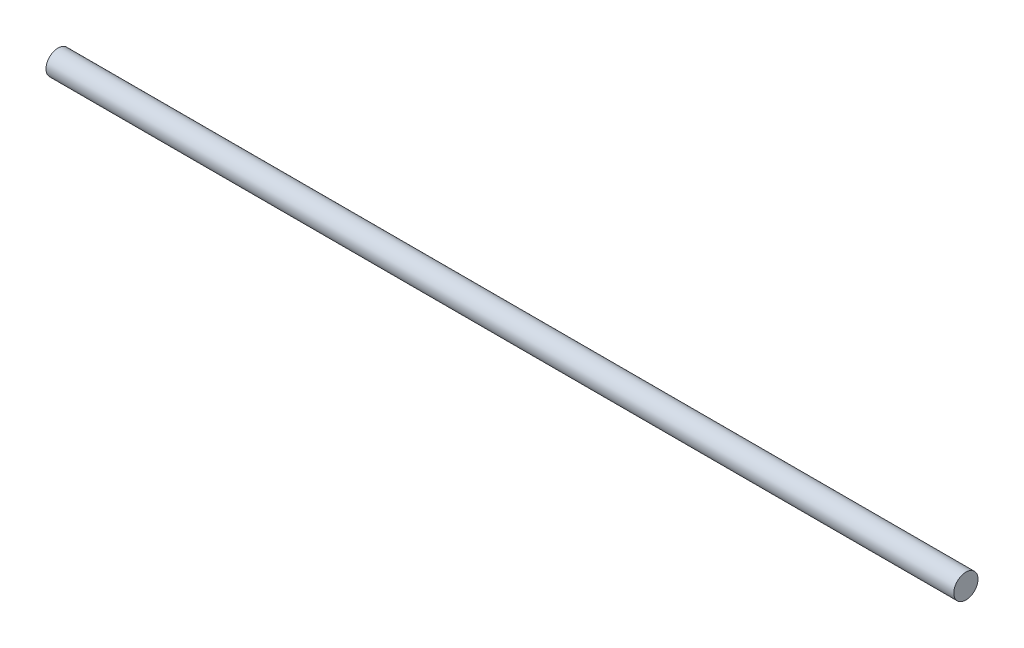
ISO-10303-21;
HEADER;
FILE_DESCRIPTION(('STEP AP214'),'2;1');
FILE_NAME('part.step','',(''),(''),'','','');
FILE_SCHEMA(('AUTOMOTIVE_DESIGN { 1 0 10303 214 1 1 1 1 }'));
ENDSEC;
DATA;
#1=APPLICATION_CONTEXT('core data for automotive mechanical design processes');
#2=APPLICATION_PROTOCOL_DEFINITION('international standard','automotive_design',2000,#1);
#3=PRODUCT_CONTEXT('',#1,'mechanical');
#4=PRODUCT('Part','Part','',(#3));
#5=PRODUCT_RELATED_PRODUCT_CATEGORY('part','',(#4));
#6=PRODUCT_DEFINITION_FORMATION('','',#4);
#7=PRODUCT_DEFINITION_CONTEXT('part definition',#1,'design');
#8=PRODUCT_DEFINITION('design','',#6,#7);
#9=PRODUCT_DEFINITION_SHAPE('','',#8);
#10=(LENGTH_UNIT() NAMED_UNIT(*) SI_UNIT(.MILLI.,.METRE.));
#11=(NAMED_UNIT(*) PLANE_ANGLE_UNIT() SI_UNIT($,.RADIAN.));
#12=(NAMED_UNIT(*) SI_UNIT($,.STERADIAN.) SOLID_ANGLE_UNIT());
#13=UNCERTAINTY_MEASURE_WITH_UNIT(LENGTH_MEASURE(1.E-05),#10,'distance_accuracy_value','');
#14=(GEOMETRIC_REPRESENTATION_CONTEXT(3) GLOBAL_UNCERTAINTY_ASSIGNED_CONTEXT((#13)) GLOBAL_UNIT_ASSIGNED_CONTEXT((#10,
#11,#12)) REPRESENTATION_CONTEXT('',''));
#15=CARTESIAN_POINT('',(0.,0.,0.));
#16=DIRECTION('',(0.,0.,1.));
#17=DIRECTION('',(1.,0.,0.));
#18=AXIS2_PLACEMENT_3D('',#15,#16,#17);
#19=CARTESIAN_POINT('',(600.,0.,0.));
#20=DIRECTION('',(-1.,0.,0.));
#21=DIRECTION('',(0.,0.,1.));
#22=AXIS2_PLACEMENT_3D('',#19,#20,#21);
#23=CYLINDRICAL_SURFACE('',#22,8.);
#24=CARTESIAN_POINT('',(600.,0.,0.));
#25=DIRECTION('',(1.,0.,0.));
#26=DIRECTION('',(0.,0.,-1.));
#27=AXIS2_PLACEMENT_3D('',#24,#25,#26);
#28=CIRCLE('',#27,8.);
#29=CARTESIAN_POINT('',(600.,0.,-8.));
#30=VERTEX_POINT('',#29);
#31=EDGE_CURVE('E10',#30,#30,#28,.T.);
#32=ORIENTED_EDGE('',*,*,#31,.F.);
#33=EDGE_LOOP('',(#32));
#34=FACE_BOUND('',#33,.T.);
#35=CARTESIAN_POINT('',(0.,0.,0.));
#36=DIRECTION('',(1.,0.,0.));
#37=DIRECTION('',(0.,0.,-1.));
#38=AXIS2_PLACEMENT_3D('',#35,#36,#37);
#39=CIRCLE('',#38,8.);
#40=CARTESIAN_POINT('',(0.,0.,-8.));
#41=VERTEX_POINT('',#40);
#42=EDGE_CURVE('E44',#41,#41,#39,.T.);
#43=ORIENTED_EDGE('',*,*,#42,.T.);
#44=EDGE_LOOP('',(#43));
#45=FACE_BOUND('',#44,.T.);
#46=ADVANCED_FACE('F41',(#34,#45),#23,.T.);
#47=CARTESIAN_POINT('',(600.,0.,0.));
#48=DIRECTION('',(1.,0.,0.));
#49=DIRECTION('',(0.,0.,-1.));
#50=AXIS2_PLACEMENT_3D('',#47,#48,#49);
#51=PLANE('',#50);
#52=ORIENTED_EDGE('',*,*,#31,.T.);
#53=EDGE_LOOP('',(#52));
#54=FACE_BOUND('',#53,.T.);
#55=ADVANCED_FACE('F58',(#54),#51,.T.);
#56=CARTESIAN_POINT('',(0.,0.,0.));
#57=DIRECTION('',(1.,0.,0.));
#58=DIRECTION('',(0.,0.,-1.));
#59=AXIS2_PLACEMENT_3D('',#56,#57,#58);
#60=PLANE('',#59);
#61=ORIENTED_EDGE('',*,*,#42,.F.);
#62=EDGE_LOOP('',(#61));
#63=FACE_BOUND('',#62,.T.);
#64=ADVANCED_FACE('F56',(#63),#60,.F.);
#65=CLOSED_SHELL('',(#46,#55,#64));
#66=MANIFOLD_SOLID_BREP('B2',#65);
#67=ADVANCED_BREP_SHAPE_REPRESENTATION('',(#18,#66),#14);
#68=SHAPE_DEFINITION_REPRESENTATION(#9,#67);
ENDSEC;
END-ISO-10303-21;
